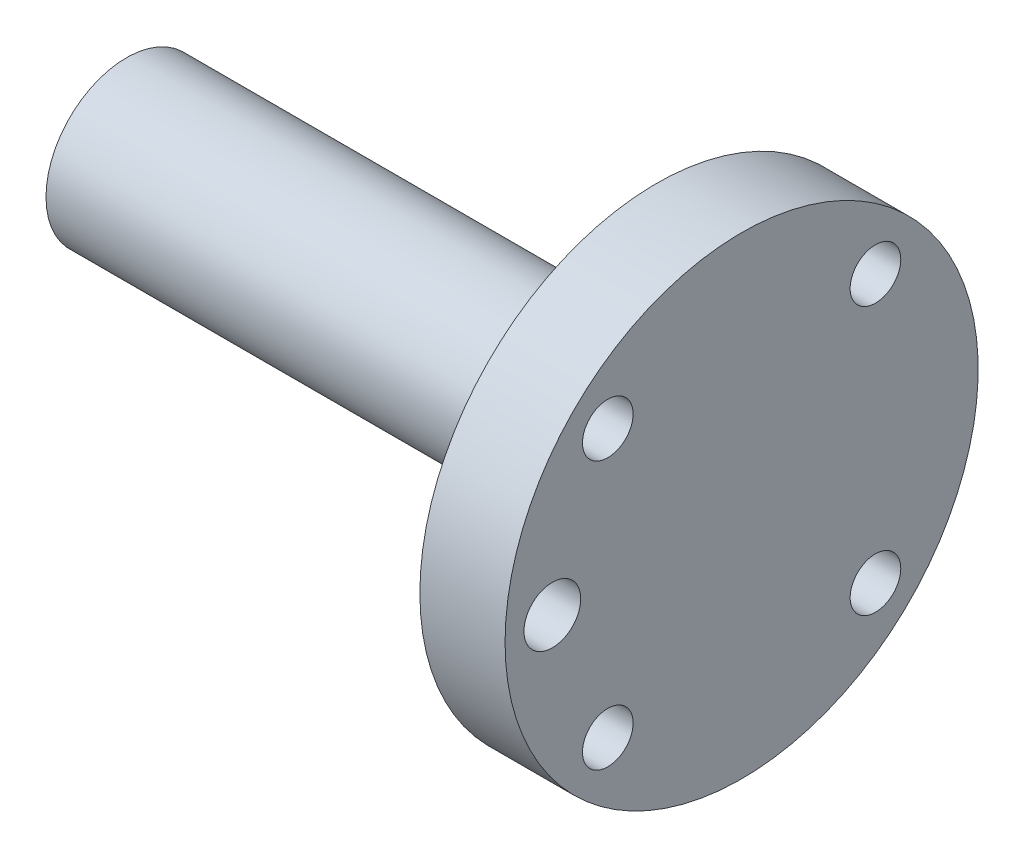
ISO-10303-21;
HEADER;
FILE_DESCRIPTION(('STEP AP214'),'2;1');
FILE_NAME('part.step','',(''),(''),'','','');
FILE_SCHEMA(('AUTOMOTIVE_DESIGN { 1 0 10303 214 1 1 1 1 }'));
ENDSEC;
DATA;
#1=APPLICATION_CONTEXT('core data for automotive mechanical design processes');
#2=APPLICATION_PROTOCOL_DEFINITION('international standard','automotive_design',2000,#1);
#3=PRODUCT_CONTEXT('',#1,'mechanical');
#4=PRODUCT('Part','Part','',(#3));
#5=PRODUCT_RELATED_PRODUCT_CATEGORY('part','',(#4));
#6=PRODUCT_DEFINITION_FORMATION('','',#4);
#7=PRODUCT_DEFINITION_CONTEXT('part definition',#1,'design');
#8=PRODUCT_DEFINITION('design','',#6,#7);
#9=PRODUCT_DEFINITION_SHAPE('','',#8);
#10=(LENGTH_UNIT() NAMED_UNIT(*) SI_UNIT(.MILLI.,.METRE.));
#11=(NAMED_UNIT(*) PLANE_ANGLE_UNIT() SI_UNIT($,.RADIAN.));
#12=(NAMED_UNIT(*) SI_UNIT($,.STERADIAN.) SOLID_ANGLE_UNIT());
#13=UNCERTAINTY_MEASURE_WITH_UNIT(LENGTH_MEASURE(1.E-05),#10,'distance_accuracy_value','');
#14=(GEOMETRIC_REPRESENTATION_CONTEXT(3) GLOBAL_UNCERTAINTY_ASSIGNED_CONTEXT((#13)) GLOBAL_UNIT_ASSIGNED_CONTEXT((#10,
#11,#12)) REPRESENTATION_CONTEXT('',''));
#15=CARTESIAN_POINT('',(0.,0.,0.));
#16=DIRECTION('',(0.,0.,1.));
#17=DIRECTION('',(1.,0.,0.));
#18=AXIS2_PLACEMENT_3D('',#15,#16,#17);
#19=CARTESIAN_POINT('',(750.,8.50199999999974,1186.5));
#20=DIRECTION('',(-1.,0.,0.));
#21=DIRECTION('',(0.,0.,1.));
#22=AXIS2_PLACEMENT_3D('',#19,#20,#21);
#23=PLANE('',#22);
#24=CARTESIAN_POINT('',(750.,0.00199999999958308,1186.5));
#25=DIRECTION('',(-1.,0.,0.));
#26=DIRECTION('',(0.,0.,1.));
#27=AXIS2_PLACEMENT_3D('',#24,#25,#26);
#28=CIRCLE('',#27,8.50000000000017);
#29=CARTESIAN_POINT('',(750.,0.00199999999958308,1195.));
#30=VERTEX_POINT('',#29);
#31=EDGE_CURVE('E19',#30,#30,#28,.F.);
#32=ORIENTED_EDGE('',*,*,#31,.F.);
#33=EDGE_LOOP('',(#32));
#34=FACE_BOUND('',#33,.T.);
#35=ADVANCED_FACE('F15',(#34),#23,.T.);
#36=CARTESIAN_POINT('',(750.,0.00199999999958308,1186.5));
#37=DIRECTION('',(-1.,0.,0.));
#38=DIRECTION('',(0.,0.,1.));
#39=AXIS2_PLACEMENT_3D('',#36,#37,#38);
#40=CYLINDRICAL_SURFACE('',#39,8.50000000000017);
#41=CARTESIAN_POINT('',(801.886087953089,0.00199999999960264,1186.5));
#42=DIRECTION('',(1.,0.,0.));
#43=DIRECTION('',(0.,1.,0.));
#44=AXIS2_PLACEMENT_3D('',#41,#42,#43);
#45=CIRCLE('',#44,8.50000000000013);
#46=CARTESIAN_POINT('',(801.886087953089,8.50199999999974,1186.5));
#47=VERTEX_POINT('',#46);
#48=EDGE_CURVE('E31',#47,#47,#45,.T.);
#49=ORIENTED_EDGE('',*,*,#48,.F.);
#50=EDGE_LOOP('',(#49));
#51=FACE_BOUND('',#50,.T.);
#52=ORIENTED_EDGE('',*,*,#31,.T.);
#53=EDGE_LOOP('',(#52));
#54=FACE_BOUND('',#53,.T.);
#55=ADVANCED_FACE('F66',(#51,#54),#40,.T.);
#56=CARTESIAN_POINT('',(805.998777568908,0.00199999999959261,1186.5));
#57=DIRECTION('',(1.,0.,0.));
#58=DIRECTION('',(0.,0.,-1.));
#59=AXIS2_PLACEMENT_3D('',#56,#57,#58);
#60=CONICAL_SURFACE('',#59,24.9950970966793,1.3264502315157);
#61=CARTESIAN_POINT('',(805.998777568908,0.00199999999958308,1186.5));
#62=DIRECTION('',(-1.,0.,0.));
#63=DIRECTION('',(0.,0.,1.));
#64=AXIS2_PLACEMENT_3D('',#61,#62,#63);
#65=CIRCLE('',#64,24.9950970966792);
#66=CARTESIAN_POINT('',(805.998777568908,0.00199999999958308,1211.49509709668));
#67=VERTEX_POINT('',#66);
#68=EDGE_CURVE('E89',#67,#67,#65,.F.);
#69=ORIENTED_EDGE('',*,*,#68,.F.);
#70=EDGE_LOOP('',(#69));
#71=FACE_BOUND('',#70,.T.);
#72=CARTESIAN_POINT('',(804.306317276133,-14.1401356279621,1175.0328643805));
#73=CARTESIAN_POINT('',(804.336143372181,-14.294141666813,1175.03285838061));
#74=CARTESIAN_POINT('',(804.36821619254,-14.4479391191232,1175.01951127642));
#75=CARTESIAN_POINT('',(804.435601045556,-14.7505341127896,1174.96683466761));
#76=CARTESIAN_POINT('',(804.470920752985,-14.8993186094879,1174.92744216448));
#77=CARTESIAN_POINT('',(804.543492453151,-15.1873102728506,1174.82411545223));
#78=CARTESIAN_POINT('',(804.580740919321,-15.3265339066501,1174.76022475459));
#79=CARTESIAN_POINT('',(804.656062215643,-15.5918298625371,1174.6098533582));
#80=CARTESIAN_POINT('',(804.694134621056,-15.7179087744918,1174.52338405576));
#81=CARTESIAN_POINT('',(804.770621651566,-15.9553237915676,1174.32880677216));
#82=CARTESIAN_POINT('',(804.809033045368,-16.0664151069824,1174.22039853297));
#83=CARTESIAN_POINT('',(804.884596137918,-16.2684091581914,1173.98575998604));
#84=CARTESIAN_POINT('',(804.921747674927,-16.3593093101102,1173.85952740068));
#85=CARTESIAN_POINT('',(804.993782553742,-16.518022559099,1173.59290261411));
#86=CARTESIAN_POINT('',(805.028668385499,-16.5858613595943,1173.45252640475));
#87=CARTESIAN_POINT('',(805.09532779561,-16.6963139649367,1173.16147938809));
#88=CARTESIAN_POINT('',(805.127101659782,-16.7389300881767,1173.01080952838));
#89=CARTESIAN_POINT('',(805.186203342983,-16.7967884160814,1172.70630915658));
#90=CARTESIAN_POINT('',(805.213599747449,-16.8125005802318,1172.55258139515));
#91=CARTESIAN_POINT('',(805.263928013503,-16.8171598885835,1172.24398703233));
#92=CARTESIAN_POINT('',(805.28686049857,-16.8061107734636,1172.08912059312));
#93=CARTESIAN_POINT('',(805.327167703311,-16.7578417994512,1171.78683044004));
#94=CARTESIAN_POINT('',(805.344667368647,-16.7212851411307,1171.63931747325));
#95=CARTESIAN_POINT('',(805.374439636682,-16.6235096237418,1171.35214285461));
#96=CARTESIAN_POINT('',(805.386712891221,-16.5622938420295,1171.21248022555));
#97=CARTESIAN_POINT('',(805.405511286793,-16.4184790463776,1170.94829338624));
#98=CARTESIAN_POINT('',(805.412159162606,-16.336390360328,1170.82349992149));
#99=CARTESIAN_POINT('',(805.420003971243,-16.1525132927662,1170.5892130436));
#100=CARTESIAN_POINT('',(805.421201888333,-16.0507284718484,1170.47971687122));
#101=CARTESIAN_POINT('',(805.418139572981,-15.8317937912344,1170.28047260955));
#102=CARTESIAN_POINT('',(805.413947294223,-15.7148516146504,1170.19049504756));
#103=CARTESIAN_POINT('',(805.400317242125,-15.4679374711301,1170.03102741576));
#104=CARTESIAN_POINT('',(805.390876944669,-15.3379592589852,1169.96154722913));
#105=CARTESIAN_POINT('',(805.366951011519,-15.0684961580842,1169.84481893532));
#106=CARTESIAN_POINT('',(805.352453971231,-14.9289903583631,1169.79762165444));
#107=CARTESIAN_POINT('',(805.318773281409,-14.6448786042143,1169.72685434754));
#108=CARTESIAN_POINT('',(805.299599729957,-14.500284205813,1169.70323396377));
#109=CARTESIAN_POINT('',(805.273080246462,-14.3194299654734,1169.68863664215));
#110=CARTESIAN_POINT('',(805.267699690944,-14.2835805130328,1169.68647215931));
#111=CARTESIAN_POINT('',(805.256688453501,-14.2118636617517,1169.68358539827));
#112=CARTESIAN_POINT('',(805.251057782854,-14.1759962637924,1169.68286305511));
#113=CARTESIAN_POINT('',(805.220797671938,-13.9874325720055,1169.6828700243));
#114=CARTESIAN_POINT('',(805.194041532217,-13.8348521308595,1169.69599764243));
#115=CARTESIAN_POINT('',(805.136704145133,-13.5345922541712,1169.74783442174));
#116=CARTESIAN_POINT('',(805.106113530124,-13.3869259819765,1169.78660726192));
#117=CARTESIAN_POINT('',(805.04193584684,-13.1011329308733,1169.88824111308));
#118=CARTESIAN_POINT('',(805.00835452378,-12.9629887287665,1169.95105667197));
#119=CARTESIAN_POINT('',(804.938979000183,-12.6997644421062,1170.09872105318));
#120=CARTESIAN_POINT('',(804.903185915055,-12.574677856725,1170.18355883751));
#121=CARTESIAN_POINT('',(804.829592199727,-12.3386793910744,1170.37447861403));
#122=CARTESIAN_POINT('',(804.791767228396,-12.2280581248542,1170.48091057271));
#123=CARTESIAN_POINT('',(804.715693679786,-12.0266322742619,1170.7110136012));
#124=CARTESIAN_POINT('',(804.677445018544,-11.9358316943029,1170.83468814631));
#125=CARTESIAN_POINT('',(804.601108257253,-11.7755696163017,1171.09753003664));
#126=CARTESIAN_POINT('',(804.563028389942,-11.7063942808929,1171.23687445983));
#127=CARTESIAN_POINT('',(804.48871046861,-11.5930794378869,1171.52586789723));
#128=CARTESIAN_POINT('',(804.45247241631,-11.5489399536575,1171.67551692105));
#129=CARTESIAN_POINT('',(804.383290418945,-11.4874325997067,1171.98001032839));
#130=CARTESIAN_POINT('',(804.350328383028,-11.4699090732043,1172.13481905119));
#131=CARTESIAN_POINT('',(804.288725742545,-11.4620636338689,1172.44599256865));
#132=CARTESIAN_POINT('',(804.26008456454,-11.4717381081324,1172.60235715387));
#133=CARTESIAN_POINT('',(804.209048415721,-11.5178450147015,1172.90781229938));
#134=CARTESIAN_POINT('',(804.186508583162,-11.5535647340541,1173.05698592985));
#135=CARTESIAN_POINT('',(804.147746227266,-11.6503171982215,1173.34775776347));
#136=CARTESIAN_POINT('',(804.131522259481,-11.7113441486365,1173.48935769234));
#137=CARTESIAN_POINT('',(804.106671271517,-11.8544939540421,1173.75553115727));
#138=CARTESIAN_POINT('',(804.097789990909,-11.9357711324302,1173.88053602926));
#139=CARTESIAN_POINT('',(804.087102903757,-12.1181249836216,1174.115475217));
#140=CARTESIAN_POINT('',(804.085295246656,-12.2191964706932,1174.22541346712));
#141=CARTESIAN_POINT('',(804.088798604648,-12.4353595318403,1174.42435933408));
#142=CARTESIAN_POINT('',(804.093931300282,-12.5500334062373,1174.51382475597));
#143=CARTESIAN_POINT('',(804.110755883485,-12.7920608074352,1174.67287880562));
#144=CARTESIAN_POINT('',(804.122450650106,-12.9194198795694,1174.74245868853));
#145=CARTESIAN_POINT('',(804.151896424036,-13.1834958030153,1174.86015282517));
#146=CARTESIAN_POINT('',(804.169666814994,-13.3202414713049,1174.90819722418));
#147=CARTESIAN_POINT('',(804.210462397092,-13.5987567443111,1174.98145034953));
#148=CARTESIAN_POINT('',(804.233477619382,-13.7405163925935,1175.00670195214));
#149=CARTESIAN_POINT('',(804.266208518885,-13.925648086296,1175.02460022908));
#150=CARTESIAN_POINT('',(804.273975802753,-13.9685317257339,1175.02769985931));
#151=CARTESIAN_POINT('',(804.289876398083,-14.0543275149698,1175.03183270183));
#152=CARTESIAN_POINT('',(804.298009685144,-14.0972396626797,1175.03286605167));
#153=CARTESIAN_POINT('',(804.306317276133,-14.1401356279621,1175.0328643805));
#154=B_SPLINE_CURVE_WITH_KNOTS('',3,(#72,#73,#74,#75,#76,#77,#78,#79,#80,#81,#82,#83,#84,#85,
#86,#87,#88,#89,#90,#91,#92,#93,#94,#95,#96,#97,#98,#99,#100,#101,#102,#103,#104,#105,#106,#107,
#108,#109,#110,#111,#112,#113,#114,#115,#116,#117,#118,#119,#120,#121,#122,#123,#124,#125,#126,
#127,#128,#129,#130,#131,#132,#133,#134,#135,#136,#137,#138,#139,#140,#141,#142,#143,#144,#145,
#146,#147,#148,#149,#150,#151,#152,#153),.UNSPECIFIED.,.T.,.F.,(4,2,2,2,2,2,2,2,2,2,2,2,2,2,2,2,
2,2,2,2,2,2,2,2,2,2,2,2,2,2,2,2,2,2,2,2,2,2,2,2,4),(0.,0.470433945646241,0.942009958367711,
1.4127522512867,1.88325739967577,2.36070003356384,2.83820373092127,3.31517345986759,
3.79209934037451,4.26060589905821,4.72904697389826,5.18574150354063,5.64237905725131,
6.08877604681168,6.53509241363955,6.97583689771166,7.41679354827737,7.8587511988115,
8.29976284162894,8.40869277676593,8.5176178048172,8.98144629721404,9.44643085562329,
9.91054068084767,10.3744183324921,10.8465199166477,11.3187167923402,11.79692077348,
12.27512520096,12.7505220527168,13.2258557571171,13.6886483191685,14.1513349776597,
14.597235524266,15.0430194093178,15.4775646652589,15.9123007233875,16.3484369085586,
16.7837509434814,16.9147916597382,17.0458236527085),.UNSPECIFIED.);
#155=CARTESIAN_POINT('',(804.306317276133,-14.1401356279621,1175.0328643805));
#156=VERTEX_POINT('',#155);
#157=EDGE_CURVE('E45',#156,#156,#154,.T.);
#158=ORIENTED_EDGE('',*,*,#157,.T.);
#159=EDGE_LOOP('',(#158));
#160=FACE_BOUND('',#159,.T.);
#161=CARTESIAN_POINT('',(804.306317275823,14.1441356195,1175.03286437204));
#162=CARTESIAN_POINT('',(804.277907504522,13.9974342534324,1175.03285851673));
#163=CARTESIAN_POINT('',(804.251462679069,13.8501653361851,1175.02075310957));
#164=CARTESIAN_POINT('',(804.203580217718,13.5586483828597,1174.97219598563));
#165=CARTESIAN_POINT('',(804.182151701003,13.4144062758309,1174.93570038679));
#166=CARTESIAN_POINT('',(804.145269209412,13.1331694066327,1174.83892932152));
#167=CARTESIAN_POINT('',(804.129819001762,12.996179261053,1174.77863890899));
#168=CARTESIAN_POINT('',(804.105669218935,12.7337845841122,1174.63576659407));
#169=CARTESIAN_POINT('',(804.096966142361,12.608374073352,1174.55319628377));
#170=CARTESIAN_POINT('',(804.086857741144,12.3756363006401,1174.37018877821));
#171=CARTESIAN_POINT('',(804.085290689998,12.2679621813766,1174.27020143863));
#172=CARTESIAN_POINT('',(804.089092105359,12.0704741250498,1174.05403170553));
#173=CARTESIAN_POINT('',(804.094460499586,11.9806600018608,1173.93784948081));
#174=CARTESIAN_POINT('',(804.111762464322,11.8223389259218,1173.69418430956));
#175=CARTESIAN_POINT('',(804.123618251663,11.7535942974233,1173.56684997971));
#176=CARTESIAN_POINT('',(804.153290614266,11.6376741609324,1173.3033772598));
#177=CARTESIAN_POINT('',(804.171107492725,11.5904997503511,1173.16723842219));
#178=CARTESIAN_POINT('',(804.21228061868,11.5180655016533,1172.88757646686));
#179=CARTESIAN_POINT('',(804.235724943237,11.4931873535647,1172.74396769188));
#180=CARTESIAN_POINT('',(804.287042696802,11.4669898123264,1172.45540715321));
#181=CARTESIAN_POINT('',(804.314916823706,11.4656741350597,1172.31045518131));
#182=CARTESIAN_POINT('',(804.375098816421,11.4866275364038,1172.01803652923));
#183=CARTESIAN_POINT('',(804.407525167872,11.5096996540118,1171.87065180072));
#184=CARTESIAN_POINT('',(804.474932442195,11.579739731971,1171.58228346559));
#185=CARTESIAN_POINT('',(804.509913821415,11.6267119700396,1171.44130100979));
#186=CARTESIAN_POINT('',(804.582507402846,11.7449853476128,1171.16496736785));
#187=CARTESIAN_POINT('',(804.620167999316,11.8170184921713,1171.02994183505));
#188=CARTESIAN_POINT('',(804.69595262147,11.982917372649,1170.77419875663));
#189=CARTESIAN_POINT('',(804.734076660341,12.0767837312358,1170.65348161923));
#190=CARTESIAN_POINT('',(804.810340745722,12.2854037191325,1170.42791477109));
#191=CARTESIAN_POINT('',(804.848471772778,12.4004602134764,1170.32334182446));
#192=CARTESIAN_POINT('',(804.923142775805,12.6473276716513,1170.13541996749));
#193=CARTESIAN_POINT('',(804.959682004648,12.7791463916588,1170.05208093643));
#194=CARTESIAN_POINT('',(805.030074064899,13.0552662364763,1169.90958868758));
#195=CARTESIAN_POINT('',(805.063936154956,13.1995203770213,1169.85034888544));
#196=CARTESIAN_POINT('',(805.128215995714,13.4966121777536,1169.75777819752));
#197=CARTESIAN_POINT('',(805.158641210583,13.6494301146449,1169.72439020563));
#198=CARTESIAN_POINT('',(805.197252900379,13.8604344832411,1169.69734335988));
#199=CARTESIAN_POINT('',(805.207270998524,13.9169599675381,1169.69192297492));
#200=CARTESIAN_POINT('',(805.226728143163,14.0303435664273,1169.68468214967));
#201=CARTESIAN_POINT('',(805.236167162808,14.0872016963087,1169.68286187619));
#202=CARTESIAN_POINT('',(805.268957989993,14.2915523620684,1169.68287083443));
#203=CARTESIAN_POINT('',(805.290580252431,14.4394772433358,1169.69509763179));
#204=CARTESIAN_POINT('',(805.329218398687,14.732039507295,1169.74404343243));
#205=CARTESIAN_POINT('',(805.346225866004,14.8766704483713,1169.78080676892));
#206=CARTESIAN_POINT('',(805.375196313336,15.1582867614334,1169.87808619387));
#207=CARTESIAN_POINT('',(805.387159210842,15.2952720083357,1169.9386026708));
#208=CARTESIAN_POINT('',(805.405739506553,15.5574472063806,1170.08179790778));
#209=CARTESIAN_POINT('',(805.412359255579,15.6826423233807,1170.16446690003));
#210=CARTESIAN_POINT('',(805.420052948293,15.9161309825548,1170.34851519349));
#211=CARTESIAN_POINT('',(805.421193771336,16.0246126190325,1170.44965313201));
#212=CARTESIAN_POINT('',(805.418083248875,16.2233638538092,1170.66840491269));
#213=CARTESIAN_POINT('',(805.413831783803,16.3136330482118,1170.78601912015));
#214=CARTESIAN_POINT('',(805.400077554574,16.4729819314918,1171.03360806554));
#215=CARTESIAN_POINT('',(805.390603978363,16.5421761073632,1171.16351080595));
#216=CARTESIAN_POINT('',(805.366649790613,16.6582488929693,1171.43249026102));
#217=CARTESIAN_POINT('',(805.35216911603,16.7051272217078,1171.57156709119));
#218=CARTESIAN_POINT('',(805.318396442475,16.7757837560654,1171.85614223758));
#219=CARTESIAN_POINT('',(805.29906548755,16.7993668991645,1172.00168428871));
#220=CARTESIAN_POINT('',(805.256100531223,16.8223916816202,1172.29402924614));
#221=CARTESIAN_POINT('',(805.232466170659,16.8218313050347,1172.44083225672));
#222=CARTESIAN_POINT('',(805.180930165152,16.7966570096041,1172.73456368663));
#223=CARTESIAN_POINT('',(805.152954384405,16.7715749009282,1172.8814388789));
#224=CARTESIAN_POINT('',(805.093729855751,16.697685499019,1173.16840054881));
#225=CARTESIAN_POINT('',(805.062480677621,16.6488750840989,1173.30848613055));
#226=CARTESIAN_POINT('',(804.996617367712,16.5276367208207,1173.58155109252));
#227=CARTESIAN_POINT('',(804.961939091197,16.4546540888711,1173.71426875059));
#228=CARTESIAN_POINT('',(804.890735046392,16.2876924679065,1173.96519295448));
#229=CARTESIAN_POINT('',(804.854209206633,16.1937126661777,1174.08339893833));
#230=CARTESIAN_POINT('',(804.779416990387,15.9852164980228,1174.30456226261));
#231=CARTESIAN_POINT('',(804.741130092465,15.870303564692,1174.40713899669));
#232=CARTESIAN_POINT('',(804.664580792164,15.6245313342803,1174.5911648487));
#233=CARTESIAN_POINT('',(804.626318416198,15.4936629826092,1174.67260188722));
#234=CARTESIAN_POINT('',(804.550576273922,15.2182810633414,1174.81264599531));
#235=CARTESIAN_POINT('',(804.513108217251,15.0736437226942,1174.87101571667));
#236=CARTESIAN_POINT('',(804.440627944513,14.7760894619912,1174.96177633558));
#237=CARTESIAN_POINT('',(804.405610438063,14.6231917253797,1174.9942248777));
#238=CARTESIAN_POINT('',(804.360961597419,14.4147479343664,1175.0196933365));
#239=CARTESIAN_POINT('',(804.349683911708,14.3608233693871,1175.02462393442));
#240=CARTESIAN_POINT('',(804.327620131863,14.2526703476335,1175.03121064566));
#241=CARTESIAN_POINT('',(804.316834070719,14.1984418707394,1175.03286653957));
#242=CARTESIAN_POINT('',(804.306317275823,14.1441356195,1175.03286437204));
#243=B_SPLINE_CURVE_WITH_KNOTS('',3,(#161,#162,#163,#164,#165,#166,#167,#168,#169,#170,#171,
#172,#173,#174,#175,#176,#177,#178,#179,#180,#181,#182,#183,#184,#185,#186,#187,#188,#189,#190,
#191,#192,#193,#194,#195,#196,#197,#198,#199,#200,#201,#202,#203,#204,#205,#206,#207,#208,#209,
#210,#211,#212,#213,#214,#215,#216,#217,#218,#219,#220,#221,#222,#223,#224,#225,#226,#227,#228,
#229,#230,#231,#232,#233,#234,#235,#236,#237,#238,#239,#240,#241,#242),.UNSPECIFIED.,.T.,.F.,(4,
2,2,2,2,2,2,2,2,2,2,2,2,2,2,2,2,2,2,2,2,2,2,2,2,2,2,2,2,2,2,2,2,2,2,2,2,2,2,2,4),(0.,
0.448077991072641,0.896964328107988,1.34613307155212,1.79506856433991,2.23377730734627,
2.67248147816449,3.10603735439041,3.53961528584343,3.98048121406555,4.4214166677535,
4.87733715428734,5.33333927159849,5.80396724700234,6.2746086460261,6.75258856358972,
7.230790461188,7.70725875708035,8.18267151777713,8.35556770741406,8.52847190724597,
8.9761658739878,9.42467094275234,9.87318334691234,10.321498311581,10.7643266961771,
11.2071649002791,11.647552683882,12.0879460126047,12.5319964880755,12.9760840410647,
13.4288194531858,13.8816144431285,14.3456171570284,14.8096378336711,15.2835920205528,
15.7578164361868,16.2368006369127,16.7147166644905,16.8805760991085,17.0464466469454),.UNSPECIFIED.);
#244=CARTESIAN_POINT('',(804.306317275823,14.1441356195,1175.03286437204));
#245=VERTEX_POINT('',#244);
#246=EDGE_CURVE('E52',#245,#245,#243,.T.);
#247=ORIENTED_EDGE('',*,*,#246,.T.);
#248=EDGE_LOOP('',(#247));
#249=FACE_BOUND('',#248,.T.);
#250=ORIENTED_EDGE('',*,*,#48,.T.);
#251=EDGE_LOOP('',(#250));
#252=FACE_BOUND('',#251,.T.);
#253=CARTESIAN_POINT('',(805.245302980286,14.1441356279612,1203.3171356195));
#254=CARTESIAN_POINT('',(805.220797671938,13.9914325720046,1203.31712997569));
#255=CARTESIAN_POINT('',(805.194041532217,13.8388521308586,1203.30400235757));
#256=CARTESIAN_POINT('',(805.136704145133,13.5385922541703,1203.25216557825));
#257=CARTESIAN_POINT('',(805.106113530124,13.3909259819756,1203.21339273808));
#258=CARTESIAN_POINT('',(805.04193584684,13.1051329308724,1203.11175888692));
#259=CARTESIAN_POINT('',(805.00835452378,12.9669887287656,1203.04894332803));
#260=CARTESIAN_POINT('',(804.938979000183,12.7037644421053,1202.90127894682));
#261=CARTESIAN_POINT('',(804.903185915055,12.5786778567241,1202.81644116249));
#262=CARTESIAN_POINT('',(804.829592199727,12.3426793910735,1202.62552138597));
#263=CARTESIAN_POINT('',(804.791767228396,12.2320581248532,1202.51908942729));
#264=CARTESIAN_POINT('',(804.715693679786,12.0306322742609,1202.2889863988));
#265=CARTESIAN_POINT('',(804.677445018544,11.939831694302,1202.16531185369));
#266=CARTESIAN_POINT('',(804.601108257253,11.7795696163008,1201.90246996336));
#267=CARTESIAN_POINT('',(804.563028389942,11.7103942808919,1201.76312554017));
#268=CARTESIAN_POINT('',(804.48871046861,11.597079437886,1201.47413210277));
#269=CARTESIAN_POINT('',(804.45247241631,11.5529399536565,1201.32448307894));
#270=CARTESIAN_POINT('',(804.383290418945,11.4914325997058,1201.01998967161));
#271=CARTESIAN_POINT('',(804.350328383028,11.4739090732034,1200.86518094881));
#272=CARTESIAN_POINT('',(804.288725742545,11.466063633868,1200.55400743135));
#273=CARTESIAN_POINT('',(804.26008456454,11.4757381081314,1200.39764284612));
#274=CARTESIAN_POINT('',(804.209048415721,11.5218450147005,1200.09218770062));
#275=CARTESIAN_POINT('',(804.186508583162,11.5575647340531,1199.94301407014));
#276=CARTESIAN_POINT('',(804.147746227266,11.6543171982205,1199.65224223652));
#277=CARTESIAN_POINT('',(804.131522259482,11.7153441486355,1199.51064230766));
#278=CARTESIAN_POINT('',(804.106671271517,11.858493954041,1199.24446884273));
#279=CARTESIAN_POINT('',(804.097789990909,11.9397711324292,1199.11946397074));
#280=CARTESIAN_POINT('',(804.087102903757,12.1221249836206,1198.884524783));
#281=CARTESIAN_POINT('',(804.085295246656,12.2231964706923,1198.77458653287));
#282=CARTESIAN_POINT('',(804.088798604648,12.4393595318393,1198.57564066592));
#283=CARTESIAN_POINT('',(804.093931300282,12.5540334062363,1198.48617524403));
#284=CARTESIAN_POINT('',(804.110755883485,12.7960608074342,1198.32712119438));
#285=CARTESIAN_POINT('',(804.122450650106,12.9234198795684,1198.25754131147));
#286=CARTESIAN_POINT('',(804.151896424036,13.1874958030144,1198.13984717483));
#287=CARTESIAN_POINT('',(804.169666814994,13.3242414713039,1198.09180277581));
#288=CARTESIAN_POINT('',(804.210462397092,13.6027567443101,1198.01854965046));
#289=CARTESIAN_POINT('',(804.233477619382,13.7445163925926,1197.99329804786));
#290=CARTESIAN_POINT('',(804.266208518885,13.929648086295,1197.97539977092));
#291=CARTESIAN_POINT('',(804.273975802754,13.972531725733,1197.97230014069));
#292=CARTESIAN_POINT('',(804.289876398083,14.0583275149688,1197.96816729817));
#293=CARTESIAN_POINT('',(804.298009685144,14.1012396626788,1197.96713394832));
#294=CARTESIAN_POINT('',(804.33614337218,14.2981416668121,1197.96714161939));
#295=CARTESIAN_POINT('',(804.36821619254,14.4519391191223,1197.98048872358));
#296=CARTESIAN_POINT('',(804.435601045556,14.7545341127887,1198.03316533239));
#297=CARTESIAN_POINT('',(804.470920752985,14.903318609487,1198.07255783552));
#298=CARTESIAN_POINT('',(804.543492453151,15.1913102728496,1198.17588454777));
#299=CARTESIAN_POINT('',(804.580740919321,15.3305339066491,1198.23977524541));
#300=CARTESIAN_POINT('',(804.656062215643,15.5958298625361,1198.3901466418));
#301=CARTESIAN_POINT('',(804.694134621056,15.7219087744909,1198.47661594423));
#302=CARTESIAN_POINT('',(804.770621651567,15.9593237915667,1198.67119322784));
#303=CARTESIAN_POINT('',(804.809033045368,16.0704151069815,1198.77960146703));
#304=CARTESIAN_POINT('',(804.884596137918,16.2724091581905,1199.01424001396));
#305=CARTESIAN_POINT('',(804.921747674927,16.3633093101093,1199.14047259932));
#306=CARTESIAN_POINT('',(804.993782553742,16.5220225590981,1199.40709738589));
#307=CARTESIAN_POINT('',(805.028668385499,16.5898613595934,1199.54747359525));
#308=CARTESIAN_POINT('',(805.09532779561,16.7003139649358,1199.83852061191));
#309=CARTESIAN_POINT('',(805.127101659782,16.7429300881758,1199.98919047162));
#310=CARTESIAN_POINT('',(805.186203342983,16.8007884160804,1200.29369084342));
#311=CARTESIAN_POINT('',(805.213599747449,16.8165005802309,1200.44741860485));
#312=CARTESIAN_POINT('',(805.263928013503,16.8211598885825,1200.75601296767));
#313=CARTESIAN_POINT('',(805.28686049857,16.8101107734626,1200.91087940688));
#314=CARTESIAN_POINT('',(805.327167703311,16.7618417994503,1201.21316955995));
#315=CARTESIAN_POINT('',(805.344667368647,16.7252851411298,1201.36068252674));
#316=CARTESIAN_POINT('',(805.374439636682,16.6275096237408,1201.64785714538));
#317=CARTESIAN_POINT('',(805.386712891221,16.5662938420286,1201.78751977444));
#318=CARTESIAN_POINT('',(805.405511286793,16.4224790463767,1202.05170661376));
#319=CARTESIAN_POINT('',(805.412159162606,16.340390360327,1202.17650007851));
#320=CARTESIAN_POINT('',(805.420003971243,16.1565132927653,1202.41078695639));
#321=CARTESIAN_POINT('',(805.421201888333,16.0547284718475,1202.52028312877));
#322=CARTESIAN_POINT('',(805.418139572981,15.8357937912335,1202.71952739044));
#323=CARTESIAN_POINT('',(805.413947294223,15.7188516146495,1202.80950495244));
#324=CARTESIAN_POINT('',(805.400317242125,15.4719374711292,1202.96897258423));
#325=CARTESIAN_POINT('',(805.390876944669,15.3419592589843,1203.03845277087));
#326=CARTESIAN_POINT('',(805.366951011519,15.0724961580832,1203.15518106468));
#327=CARTESIAN_POINT('',(805.352453971231,14.9329903583622,1203.20237834555));
#328=CARTESIAN_POINT('',(805.318773281409,14.6488786042133,1203.27314565245));
#329=CARTESIAN_POINT('',(805.299599729957,14.5042842058121,1203.29676603623));
#330=CARTESIAN_POINT('',(805.273080246462,14.3234299654724,1203.31136335785));
#331=CARTESIAN_POINT('',(805.267699690944,14.2875805130318,1203.31352784069));
#332=CARTESIAN_POINT('',(805.256688453501,14.2158636617508,1203.31641460172));
#333=CARTESIAN_POINT('',(805.251057782854,14.1799962637915,1203.31713694488));
#334=CARTESIAN_POINT('',(805.245302980286,14.1441356279612,1203.3171356195));
#335=B_SPLINE_CURVE_WITH_KNOTS('',3,(#253,#254,#255,#256,#257,#258,#259,#260,#261,#262,#263,
#264,#265,#266,#267,#268,#269,#270,#271,#272,#273,#274,#275,#276,#277,#278,#279,#280,#281,#282,
#283,#284,#285,#286,#287,#288,#289,#290,#291,#292,#293,#294,#295,#296,#297,#298,#299,#300,#301,
#302,#303,#304,#305,#306,#307,#308,#309,#310,#311,#312,#313,#314,#315,#316,#317,#318,#319,#320,
#321,#322,#323,#324,#325,#326,#327,#328,#329,#330,#331,#332,#333,#334),.UNSPECIFIED.,.T.,.F.,(4,
2,2,2,2,2,2,2,2,2,2,2,2,2,2,2,2,2,2,2,2,2,2,2,2,2,2,2,2,2,2,2,2,2,2,2,2,2,2,2,4),(0.,
0.463828492396879,0.928813050806076,1.39292287603047,1.85680052767486,2.32890211183064,
2.80109898752302,3.27930296866281,3.75750739614278,4.23290424789958,4.70823795229993,
5.17103051435113,5.63371717284224,6.07961771944878,6.52540160450064,6.95994686044162,
7.39468291857029,7.83081910374145,8.26613313866416,8.39717385492105,8.52820584789139,
8.99863979353759,9.47021580625907,9.940958099178,10.4114632475672,10.8889058814552,
11.3664095788126,11.843379307759,12.3203051882659,12.7888117469496,13.2572528217896,
13.713947351432,14.1705849051427,14.616981894703,15.0632982615309,15.504042745603,
15.9449993961687,16.3869570467029,16.8279686895203,16.9368986246573,17.0458236527085),.UNSPECIFIED.);
#336=CARTESIAN_POINT('',(805.245302980286,14.1441356279612,1203.3171356195));
#337=VERTEX_POINT('',#336);
#338=EDGE_CURVE('E94',#337,#337,#335,.T.);
#339=ORIENTED_EDGE('',*,*,#338,.T.);
#340=EDGE_LOOP('',(#339));
#341=FACE_BOUND('',#340,.T.);
#342=CARTESIAN_POINT('',(805.245302980542,-14.1401356195004,1203.31713562796));
#343=CARTESIAN_POINT('',(805.268957989993,-14.2875523620689,1203.31712916557));
#344=CARTESIAN_POINT('',(805.290580252431,-14.4354772433362,1203.3049023682));
#345=CARTESIAN_POINT('',(805.329218398687,-14.7280395072955,1203.25595656756));
#346=CARTESIAN_POINT('',(805.346225866003,-14.8726704483718,1203.21919323108));
#347=CARTESIAN_POINT('',(805.375196313335,-15.154286761434,1203.12191380613));
#348=CARTESIAN_POINT('',(805.387159210842,-15.2912720083363,1203.06139732919));
#349=CARTESIAN_POINT('',(805.405739506553,-15.5534472063812,1202.91820209222));
#350=CARTESIAN_POINT('',(805.412359255579,-15.6786423233813,1202.83553309996));
#351=CARTESIAN_POINT('',(805.420052948293,-15.9121309825554,1202.6514848065));
#352=CARTESIAN_POINT('',(805.421193771336,-16.0206126190332,1202.55034686798));
#353=CARTESIAN_POINT('',(805.418083248875,-16.2193638538099,1202.3315950873));
#354=CARTESIAN_POINT('',(805.413831783803,-16.3096330482124,1202.21398087985));
#355=CARTESIAN_POINT('',(805.400077554574,-16.4689819314925,1201.96639193445));
#356=CARTESIAN_POINT('',(805.390603978363,-16.538176107364,1201.83648919405));
#357=CARTESIAN_POINT('',(805.366649790613,-16.6542488929702,1201.56750973897));
#358=CARTESIAN_POINT('',(805.35216911603,-16.7011272217086,1201.42843290881));
#359=CARTESIAN_POINT('',(805.318396442475,-16.7717837560662,1201.14385776242));
#360=CARTESIAN_POINT('',(805.29906548755,-16.7953668991653,1200.99831571129));
#361=CARTESIAN_POINT('',(805.256100531223,-16.8183916816211,1200.70597075385));
#362=CARTESIAN_POINT('',(805.232466170659,-16.8178313050357,1200.55916774328));
#363=CARTESIAN_POINT('',(805.180930165152,-16.7926570096051,1200.26543631337));
#364=CARTESIAN_POINT('',(805.152954384405,-16.7675749009292,1200.11856112109));
#365=CARTESIAN_POINT('',(805.093729855751,-16.69368549902,1199.83159945118));
#366=CARTESIAN_POINT('',(805.062480677621,-16.6448750841,1199.69151386945));
#367=CARTESIAN_POINT('',(804.996617367712,-16.5236367208219,1199.41844890748));
#368=CARTESIAN_POINT('',(804.961939091197,-16.4506540888723,1199.28573124941));
#369=CARTESIAN_POINT('',(804.890735046392,-16.2836924679077,1199.03480704552));
#370=CARTESIAN_POINT('',(804.854209206633,-16.1897126661789,1198.91660106167));
#371=CARTESIAN_POINT('',(804.779416990387,-15.9812164980242,1198.69543773738));
#372=CARTESIAN_POINT('',(804.741130092465,-15.8663035646934,1198.59286100331));
#373=CARTESIAN_POINT('',(804.664580792164,-15.6205313342817,1198.40883515129));
#374=CARTESIAN_POINT('',(804.626318416198,-15.4896629826105,1198.32739811277));
#375=CARTESIAN_POINT('',(804.550576273922,-15.2142810633428,1198.18735400469));
#376=CARTESIAN_POINT('',(804.513108217251,-15.0696437226957,1198.12898428333));
#377=CARTESIAN_POINT('',(804.440627944513,-14.7720894619927,1198.03822366442));
#378=CARTESIAN_POINT('',(804.405610438063,-14.6191917253811,1198.0057751223));
#379=CARTESIAN_POINT('',(804.360961597419,-14.4107479343677,1197.9803066635));
#380=CARTESIAN_POINT('',(804.349683911708,-14.3568233693883,1197.97537606558));
#381=CARTESIAN_POINT('',(804.327620131863,-14.2486703476345,1197.96878935433));
#382=CARTESIAN_POINT('',(804.316834070719,-14.1944418707403,1197.96713346043));
#383=CARTESIAN_POINT('',(804.277907504522,-13.9934342534332,1197.96714148327));
#384=CARTESIAN_POINT('',(804.251462679069,-13.8461653361858,1197.97924689043));
#385=CARTESIAN_POINT('',(804.203580217718,-13.5546483828605,1198.02780401436));
#386=CARTESIAN_POINT('',(804.182151701002,-13.4104062758317,1198.0642996132));
#387=CARTESIAN_POINT('',(804.145269209412,-13.1291694066335,1198.16107067847));
#388=CARTESIAN_POINT('',(804.129819001761,-12.9921792610539,1198.221361091));
#389=CARTESIAN_POINT('',(804.105669218934,-12.729784584113,1198.36423340593));
#390=CARTESIAN_POINT('',(804.09696614236,-12.6043740733529,1198.44680371623));
#391=CARTESIAN_POINT('',(804.086857741144,-12.3716363006409,1198.62981122179));
#392=CARTESIAN_POINT('',(804.085290689998,-12.2639621813775,1198.72979856137));
#393=CARTESIAN_POINT('',(804.089092105359,-12.0664741250507,1198.94596829446));
#394=CARTESIAN_POINT('',(804.094460499586,-11.9766600018616,1199.06215051918));
#395=CARTESIAN_POINT('',(804.111762464322,-11.8183389259225,1199.30581569044));
#396=CARTESIAN_POINT('',(804.123618251663,-11.749594297424,1199.43315002028));
#397=CARTESIAN_POINT('',(804.153290614266,-11.6336741609333,1199.6966227402));
#398=CARTESIAN_POINT('',(804.171107492725,-11.586499750352,1199.83276157781));
#399=CARTESIAN_POINT('',(804.21228061868,-11.5140655016542,1200.11242353314));
#400=CARTESIAN_POINT('',(804.235724943237,-11.4891873535656,1200.25603230812));
#401=CARTESIAN_POINT('',(804.287042696802,-11.4629898123273,1200.54459284678));
#402=CARTESIAN_POINT('',(804.314916823706,-11.4616741350606,1200.68954481869));
#403=CARTESIAN_POINT('',(804.375098816421,-11.4826275364047,1200.98196347077));
#404=CARTESIAN_POINT('',(804.407525167872,-11.5056996540128,1201.12934819928));
#405=CARTESIAN_POINT('',(804.474932442195,-11.575739731972,1201.41771653441));
#406=CARTESIAN_POINT('',(804.509913821415,-11.6227119700406,1201.55869899021));
#407=CARTESIAN_POINT('',(804.582507402846,-11.7409853476138,1201.83503263214));
#408=CARTESIAN_POINT('',(804.620167999316,-11.8130184921723,1201.97005816495));
#409=CARTESIAN_POINT('',(804.69595262147,-11.9789173726499,1202.22580124336));
#410=CARTESIAN_POINT('',(804.734076660341,-12.0727837312368,1202.34651838077));
#411=CARTESIAN_POINT('',(804.810340745722,-12.2814037191335,1202.57208522891));
#412=CARTESIAN_POINT('',(804.848471772778,-12.3964602134774,1202.67665817554));
#413=CARTESIAN_POINT('',(804.923142775805,-12.6433276716524,1202.8645800325));
#414=CARTESIAN_POINT('',(804.959682004648,-12.7751463916598,1202.94791906356));
#415=CARTESIAN_POINT('',(805.030074064899,-13.0512662364774,1203.09041131241));
#416=CARTESIAN_POINT('',(805.063936154956,-13.1955203770224,1203.14965111455));
#417=CARTESIAN_POINT('',(805.128215995714,-13.4926121777548,1203.24222180248));
#418=CARTESIAN_POINT('',(805.158641210583,-13.6454301146461,1203.27560979437));
#419=CARTESIAN_POINT('',(805.197252900379,-13.8564344832422,1203.30265664012));
#420=CARTESIAN_POINT('',(805.207270998524,-13.9129599675391,1203.30807702508));
#421=CARTESIAN_POINT('',(805.226728143163,-14.0263435664281,1203.31531785032));
#422=CARTESIAN_POINT('',(805.236167162808,-14.0832016963093,1203.3171381238));
#423=CARTESIAN_POINT('',(805.245302980542,-14.1401356195004,1203.31713562796));
#424=B_SPLINE_CURVE_WITH_KNOTS('',3,(#342,#343,#344,#345,#346,#347,#348,#349,#350,#351,#352,
#353,#354,#355,#356,#357,#358,#359,#360,#361,#362,#363,#364,#365,#366,#367,#368,#369,#370,#371,
#372,#373,#374,#375,#376,#377,#378,#379,#380,#381,#382,#383,#384,#385,#386,#387,#388,#389,#390,
#391,#392,#393,#394,#395,#396,#397,#398,#399,#400,#401,#402,#403,#404,#405,#406,#407,#408,#409,
#410,#411,#412,#413,#414,#415,#416,#417,#418,#419,#420,#421,#422,#423),.UNSPECIFIED.,.T.,.F.,(4,
2,2,2,2,2,2,2,2,2,2,2,2,2,2,2,2,2,2,2,2,2,2,2,2,2,2,2,2,2,2,2,2,2,2,2,2,2,2,2,4),(0.,
0.447693966741851,0.896199035506351,1.34471143966649,1.79302640433506,2.23585478893117,
2.67869299303308,3.11908077663604,3.55947410535878,4.00352458082932,4.44761213381858,
4.90034754593983,5.35314253588253,5.81714524978263,6.28116592642503,6.75512011330684,
7.22934452894081,7.70832872966679,8.18624475724454,8.35210419186283,8.51797473970003,
8.96605273077269,9.41493906780804,9.86410781125206,10.3130433040398,10.7517520470463,
11.1904562178646,11.6240120940907,12.0575900255435,12.4984559537656,12.9393914074536,
13.3953118939874,13.8513140112986,14.3219419867022,14.7925833857259,15.2705633032896,
15.7487652008881,16.2252334967805,16.7006462574773,16.8735424471139,17.0464466469454),.UNSPECIFIED.);
#425=CARTESIAN_POINT('',(805.245302980542,-14.1401356195004,1203.31713562796));
#426=VERTEX_POINT('',#425);
#427=EDGE_CURVE('E82',#426,#426,#424,.T.);
#428=ORIENTED_EDGE('',*,*,#427,.T.);
#429=EDGE_LOOP('',(#428));
#430=FACE_BOUND('',#429,.T.);
#431=CARTESIAN_POINT('',(804.005375977256,0.00200000598257424,1203.5));
#432=CARTESIAN_POINT('',(804.005378698996,0.165590515972742,1203.50000726628));
#433=CARTESIAN_POINT('',(804.009325582112,0.329413422535701,1203.51344552898));
#434=CARTESIAN_POINT('',(804.024929546932,0.652548416779,1203.56679172132));
#435=CARTESIAN_POINT('',(804.036603664906,0.811849724527948,1203.60675813823));
#436=CARTESIAN_POINT('',(804.067056287631,1.12094929800738,1203.7117161401));
#437=CARTESIAN_POINT('',(804.085821928492,1.27076420076649,1203.77666241583));
#438=CARTESIAN_POINT('',(804.129571818608,1.55713249941069,1203.92941583499));
#439=CARTESIAN_POINT('',(804.15455363273,1.69369105930663,1204.017214027));
#440=CARTESIAN_POINT('',(804.210221600525,1.95275025572973,1204.21491107757));
#441=CARTESIAN_POINT('',(804.241008935118,2.07492710487464,1204.32520532511));
#442=CARTESIAN_POINT('',(804.306760838861,2.29917511819456,1204.56356533669));
#443=CARTESIAN_POINT('',(804.341726433513,2.40124133011577,1204.69163546485));
#444=CARTESIAN_POINT('',(804.415965772035,2.58625798438635,1204.96699211476));
#445=CARTESIAN_POINT('',(804.45535022883,2.66837399068237,1205.11480968547));
#446=CARTESIAN_POINT('',(804.536029067865,2.80655699457865,1205.42167366377));
#447=CARTESIAN_POINT('',(804.577323731557,2.86262013999829,1205.5807217279));
#448=CARTESIAN_POINT('',(804.661739525298,2.94849749941558,1205.91017093943));
#449=CARTESIAN_POINT('',(804.704879892122,2.97756402074164,1206.08076249409));
#450=CARTESIAN_POINT('',(804.790686900541,3.00600654845928,1206.42452956014));
#451=CARTESIAN_POINT('',(804.833353509972,3.00538055119992,1206.59770524512));
#452=CARTESIAN_POINT('',(804.917396117855,2.97420472251456,1206.94301860666));
#453=CARTESIAN_POINT('',(804.958760511435,2.94343789350891,1207.11513964529));
#454=CARTESIAN_POINT('',(805.038813550864,2.85228228214426,1207.45201623267));
#455=CARTESIAN_POINT('',(805.077502277742,2.79189439726719,1207.61677200441));
#456=CARTESIAN_POINT('',(805.150806437455,2.64381315173636,1207.93206251252));
#457=CARTESIAN_POINT('',(805.185464109928,2.55644642808215,1208.08274068298));
#458=CARTESIAN_POINT('',(805.250372117164,2.35642828916421,1208.36732440816));
#459=CARTESIAN_POINT('',(805.280623351248,2.24378204521285,1208.50123338454));
#460=CARTESIAN_POINT('',(805.335337844723,1.99916300942569,1208.74510161118));
#461=CARTESIAN_POINT('',(805.359918721163,1.86769708962044,1208.85554287633));
#462=CARTESIAN_POINT('',(805.403590442355,1.58716409224652,1209.0527722294));
#463=CARTESIAN_POINT('',(805.422679439672,1.43809111550137,1209.13955235734));
#464=CARTESIAN_POINT('',(805.454509351605,1.13044093144861,1209.2847623764));
#465=CARTESIAN_POINT('',(805.467388363114,0.972167762013821,1209.34380816412));
#466=CARTESIAN_POINT('',(805.487127862613,0.647842505122526,1209.4344710995));
#467=CARTESIAN_POINT('',(805.494001983464,0.481808944387827,1209.46615037533));
#468=CARTESIAN_POINT('',(805.498984777458,0.2625693904014,1209.48912040644));
#469=CARTESIAN_POINT('',(805.499868913564,0.210549169513597,1209.49319707471));
#470=CARTESIAN_POINT('',(805.501048730182,0.106360089571338,1209.49863802007));
#471=CARTESIAN_POINT('',(805.501344410136,0.0541912303759093,1209.50000229459));
#472=CARTESIAN_POINT('',(805.50134267611,-0.163452456382098,1209.49999272586));
#473=CARTESIAN_POINT('',(805.498365695135,-0.329129681449085,1209.48625189266));
#474=CARTESIAN_POINT('',(805.486510993207,-0.655975909800005,1209.43165909255));
#475=CARTESIAN_POINT('',(805.477620687347,-0.817134532486106,1209.3907493042));
#476=CARTESIAN_POINT('',(805.454149030561,-1.1299594907076,1209.28315871048));
#477=CARTESIAN_POINT('',(805.439574886993,-1.2816375664939,1209.21651054358));
#478=CARTESIAN_POINT('',(805.405074498114,-1.57144561879035,1209.05957470964));
#479=CARTESIAN_POINT('',(805.385150592375,-1.70958148165553,1208.96929737662));
#480=CARTESIAN_POINT('',(805.340181939364,-1.96995813296485,1208.76689710034));
#481=CARTESIAN_POINT('',(805.315091021028,-2.09203809787451,1208.65457765284));
#482=CARTESIAN_POINT('',(805.260462389698,-2.3156509034238,1208.41199339088));
#483=CARTESIAN_POINT('',(805.230923901181,-2.41718015338507,1208.28172544709));
#484=CARTESIAN_POINT('',(805.167369187226,-2.59916893667848,1208.00401759259));
#485=CARTESIAN_POINT('',(805.133270080239,-2.6791264405154,1207.85626774747));
#486=CARTESIAN_POINT('',(805.061881693397,-2.8131455417451,1207.55018070778));
#487=CARTESIAN_POINT('',(805.024592046576,-2.86720415559157,1207.39184229581));
#488=CARTESIAN_POINT('',(804.946735958998,-2.94924390446254,1207.06500374987));
#489=CARTESIAN_POINT('',(804.906111911923,-2.97655944762816,1206.89635018434));
#490=CARTESIAN_POINT('',(804.82340099595,-3.00227333422881,1206.5572044025));
#491=CARTESIAN_POINT('',(804.781313955507,-3.00066827500389,1206.38671197221));
#492=CARTESIAN_POINT('',(804.695972929759,-2.96839851366481,1206.0454124538));
#493=CARTESIAN_POINT('',(804.652711740303,-2.93719824904255,1205.87465758772));
#494=CARTESIAN_POINT('',(804.567020000632,-2.84580489384112,1205.5408568534));
#495=CARTESIAN_POINT('',(804.524589510349,-2.78560971938905,1205.37781154016));
#496=CARTESIAN_POINT('',(804.441742971669,-2.63747746097796,1205.06353159254));
#497=CARTESIAN_POINT('',(804.401334537758,-2.54944349591095,1204.91234054029));
#498=CARTESIAN_POINT('',(804.324129453416,-2.34792857270639,1204.62694396571));
#499=CARTESIAN_POINT('',(804.287332277628,-2.23445132389592,1204.49273597191));
#500=CARTESIAN_POINT('',(804.219439307145,-1.98724860226946,1204.24774884107));
#501=CARTESIAN_POINT('',(804.18825381466,-1.85391879442116,1204.13659573637));
#502=CARTESIAN_POINT('',(804.13217160759,-1.56910318263728,1203.93841489554));
#503=CARTESIAN_POINT('',(804.107276654552,-1.41761231051062,1203.85139391651));
#504=CARTESIAN_POINT('',(804.065761512084,-1.10637510300304,1203.70716209547));
#505=CARTESIAN_POINT('',(804.048888972369,-0.947083976212568,1203.64903907867));
#506=CARTESIAN_POINT('',(804.023098245102,-0.620629883175008,1203.56047596755));
#507=CARTESIAN_POINT('',(804.01416036254,-0.45348749803367,1203.52996732652));
#508=CARTESIAN_POINT('',(804.008068291168,-0.23740481720408,1203.50918130817));
#509=CARTESIAN_POINT('',(804.007059721668,-0.18959968733679,1203.50574111596));
#510=CARTESIAN_POINT('',(804.005713165203,-0.0938696903703018,1203.5011493948));
#511=CARTESIAN_POINT('',(804.005375179573,-0.0459448230330719,1203.49999787041));
#512=CARTESIAN_POINT('',(804.005375977256,0.00200000598257424,1203.5));
#513=B_SPLINE_CURVE_WITH_KNOTS('',3,(#431,#432,#433,#434,#435,#436,#437,#438,#439,#440,#441,
#442,#443,#444,#445,#446,#447,#448,#449,#450,#451,#452,#453,#454,#455,#456,#457,#458,#459,#460,
#461,#462,#463,#464,#465,#466,#467,#468,#469,#470,#471,#472,#473,#474,#475,#476,#477,#478,#479,
#480,#481,#482,#483,#484,#485,#486,#487,#488,#489,#490,#491,#492,#493,#494,#495,#496,#497,#498,
#499,#500,#501,#502,#503,#504,#505,#506,#507,#508,#509,#510,#511,#512),.UNSPECIFIED.,.T.,.F.,(4,
2,2,2,2,2,2,2,2,2,2,2,2,2,2,2,2,2,2,2,2,2,2,2,2,2,2,2,2,2,2,2,2,2,2,2,2,2,2,2,4),(0.,
0.490584176925574,0.982253565753656,1.47303532361955,1.96362512363096,2.46372396257445,
2.96394579760181,3.48243952513473,4.00100989286769,4.5335480281431,5.06612209913912,
5.6025588042119,6.13897925690964,6.66914420494549,7.1992007983365,7.71700617871874,
8.2349855425794,8.7408437971393,9.24555059799774,9.40206085467834,9.55857125984879,
10.0547280797382,10.5519442277574,11.0485319228917,11.544902801631,12.045918197217,
12.5470210561925,13.0589389592387,13.5709158209401,14.0953335072872,14.6198128945176,
15.1539681752356,15.6881618515837,16.2242354091954,16.7602308644392,17.286701217164,
17.8133188349912,18.3220485027556,18.8295118678396,18.9732911597191,19.1170707376537),.UNSPECIFIED.);
#514=CARTESIAN_POINT('',(804.005375977256,0.00200000598257424,1203.5));
#515=VERTEX_POINT('',#514);
#516=EDGE_CURVE('E88',#515,#515,#513,.T.);
#517=ORIENTED_EDGE('',*,*,#516,.T.);
#518=EDGE_LOOP('',(#517));
#519=FACE_BOUND('',#518,.T.);
#520=ADVANCED_FACE('F60',(#71,#160,#249,#252,#341,#430,#519),#60,.T.);
#521=CARTESIAN_POINT('',(750.,0.00199999999958308,1186.5));
#522=DIRECTION('',(-1.,0.,0.));
#523=DIRECTION('',(0.,0.,1.));
#524=AXIS2_PLACEMENT_3D('',#521,#522,#523);
#525=CYLINDRICAL_SURFACE('',#524,24.9950970966792);
#526=ORIENTED_EDGE('',*,*,#68,.T.);
#527=EDGE_LOOP('',(#526));
#528=FACE_BOUND('',#527,.T.);
#529=CARTESIAN_POINT('',(815.000000000001,0.00199999999958308,1186.5));
#530=DIRECTION('',(-1.,0.,0.));
#531=DIRECTION('',(0.,0.,1.));
#532=AXIS2_PLACEMENT_3D('',#529,#530,#531);
#533=CIRCLE('',#532,24.9950970966792);
#534=CARTESIAN_POINT('',(815.000000000001,0.00199999999958308,1211.49509709668));
#535=VERTEX_POINT('',#534);
#536=EDGE_CURVE('E42',#535,#535,#533,.F.);
#537=ORIENTED_EDGE('',*,*,#536,.F.);
#538=EDGE_LOOP('',(#537));
#539=FACE_BOUND('',#538,.T.);
#540=ADVANCED_FACE('F65',(#528,#539),#525,.T.);
#541=CARTESIAN_POINT('',(804.0180383785,-14.1401356195008,1200.64213562796));
#542=DIRECTION('',(1.,0.,0.));
#543=DIRECTION('',(0.,0.,-1.));
#544=AXIS2_PLACEMENT_3D('',#541,#542,#543);
#545=CYLINDRICAL_SURFACE('',#544,2.67499999999998);
#546=ORIENTED_EDGE('',*,*,#427,.F.);
#547=EDGE_LOOP('',(#546));
#548=FACE_BOUND('',#547,.T.);
#549=CARTESIAN_POINT('',(815.000000000001,-14.1401356195008,1200.64213562796));
#550=DIRECTION('',(1.,0.,0.));
#551=DIRECTION('',(0.,0.,-1.));
#552=AXIS2_PLACEMENT_3D('',#549,#550,#551);
#553=CIRCLE('',#552,2.67499999999998);
#554=CARTESIAN_POINT('',(815.000000000001,-14.1401356195008,1197.96713562796));
#555=VERTEX_POINT('',#554);
#556=EDGE_CURVE('E39',#555,#555,#553,.F.);
#557=ORIENTED_EDGE('',*,*,#556,.F.);
#558=EDGE_LOOP('',(#557));
#559=FACE_BOUND('',#558,.T.);
#560=ADVANCED_FACE('F73',(#548,#559),#545,.F.);
#561=CARTESIAN_POINT('',(803.939408232956,0.00200000598257408,1206.5));
#562=DIRECTION('',(1.,0.,0.));
#563=DIRECTION('',(0.,0.,-1.));
#564=AXIS2_PLACEMENT_3D('',#561,#562,#563);
#565=CYLINDRICAL_SURFACE('',#564,2.99999999999989);
#566=CARTESIAN_POINT('',(815.000000000001,0.00200000598257408,1206.5));
#567=DIRECTION('',(1.,0.,0.));
#568=DIRECTION('',(0.,0.,-1.));
#569=AXIS2_PLACEMENT_3D('',#566,#567,#568);
#570=CIRCLE('',#569,2.99999999999989);
#571=CARTESIAN_POINT('',(815.000000000001,0.00200000598257408,1203.5));
#572=VERTEX_POINT('',#571);
#573=EDGE_CURVE('E36',#572,#572,#570,.F.);
#574=ORIENTED_EDGE('',*,*,#573,.F.);
#575=EDGE_LOOP('',(#574));
#576=FACE_BOUND('',#575,.T.);
#577=ORIENTED_EDGE('',*,*,#516,.F.);
#578=EDGE_LOOP('',(#577));
#579=FACE_BOUND('',#578,.T.);
#580=ADVANCED_FACE('F78',(#576,#579),#565,.F.);
#581=CARTESIAN_POINT('',(804.016401959602,14.1441356279612,1200.6421356195));
#582=DIRECTION('',(1.,0.,0.));
#583=DIRECTION('',(0.,0.,-1.));
#584=AXIS2_PLACEMENT_3D('',#581,#582,#583);
#585=CYLINDRICAL_SURFACE('',#584,2.67499999999998);
#586=ORIENTED_EDGE('',*,*,#338,.F.);
#587=EDGE_LOOP('',(#586));
#588=FACE_BOUND('',#587,.T.);
#589=CARTESIAN_POINT('',(815.000000000001,14.1441356279612,1200.6421356195));
#590=DIRECTION('',(1.,0.,0.));
#591=DIRECTION('',(0.,0.,-1.));
#592=AXIS2_PLACEMENT_3D('',#589,#590,#591);
#593=CIRCLE('',#592,2.67499999999998);
#594=CARTESIAN_POINT('',(815.000000000001,14.1441356279612,1197.9671356195));
#595=VERTEX_POINT('',#594);
#596=EDGE_CURVE('E28',#595,#595,#593,.F.);
#597=ORIENTED_EDGE('',*,*,#596,.F.);
#598=EDGE_LOOP('',(#597));
#599=FACE_BOUND('',#598,.T.);
#600=ADVANCED_FACE('F99',(#588,#599),#585,.F.);
#601=CARTESIAN_POINT('',(804.24215517979,14.1441356194999,1172.35786437204));
#602=DIRECTION('',(1.,0.,0.));
#603=DIRECTION('',(0.,0.,-1.));
#604=AXIS2_PLACEMENT_3D('',#601,#602,#603);
#605=CYLINDRICAL_SURFACE('',#604,2.67499999999998);
#606=ORIENTED_EDGE('',*,*,#246,.F.);
#607=EDGE_LOOP('',(#606));
#608=FACE_BOUND('',#607,.T.);
#609=CARTESIAN_POINT('',(815.000000000001,14.1441356194999,1172.35786437204));
#610=DIRECTION('',(1.,0.,0.));
#611=DIRECTION('',(0.,0.,-1.));
#612=AXIS2_PLACEMENT_3D('',#609,#610,#611);
#613=CIRCLE('',#612,2.67499999999998);
#614=CARTESIAN_POINT('',(815.000000000001,14.1441356194999,1169.68286437204));
#615=VERTEX_POINT('',#614);
#616=EDGE_CURVE('E23',#615,#615,#613,.F.);
#617=ORIENTED_EDGE('',*,*,#616,.F.);
#618=EDGE_LOOP('',(#617));
#619=FACE_BOUND('',#618,.T.);
#620=ADVANCED_FACE('F102',(#608,#619),#605,.F.);
#621=CARTESIAN_POINT('',(804.242155179478,-14.1401356279621,1172.3578643805));
#622=DIRECTION('',(1.,0.,0.));
#623=DIRECTION('',(0.,0.,-1.));
#624=AXIS2_PLACEMENT_3D('',#621,#622,#623);
#625=CYLINDRICAL_SURFACE('',#624,2.67499999999998);
#626=ORIENTED_EDGE('',*,*,#157,.F.);
#627=EDGE_LOOP('',(#626));
#628=FACE_BOUND('',#627,.T.);
#629=CARTESIAN_POINT('',(815.000000000001,-14.1401356279621,1172.3578643805));
#630=DIRECTION('',(1.,0.,0.));
#631=DIRECTION('',(0.,0.,-1.));
#632=AXIS2_PLACEMENT_3D('',#629,#630,#631);
#633=CIRCLE('',#632,2.67499999999998);
#634=CARTESIAN_POINT('',(815.000000000001,-14.1401356279621,1169.6828643805));
#635=VERTEX_POINT('',#634);
#636=EDGE_CURVE('E10',#635,#635,#633,.F.);
#637=ORIENTED_EDGE('',*,*,#636,.F.);
#638=EDGE_LOOP('',(#637));
#639=FACE_BOUND('',#638,.T.);
#640=ADVANCED_FACE('F58',(#628,#639),#625,.F.);
#641=CARTESIAN_POINT('',(815.000000000001,0.00199999999958308,1186.5));
#642=DIRECTION('',(1.,0.,0.));
#643=DIRECTION('',(0.,0.,-1.));
#644=AXIS2_PLACEMENT_3D('',#641,#642,#643);
#645=PLANE('',#644);
#646=ORIENTED_EDGE('',*,*,#636,.T.);
#647=EDGE_LOOP('',(#646));
#648=FACE_BOUND('',#647,.T.);
#649=ORIENTED_EDGE('',*,*,#616,.T.);
#650=EDGE_LOOP('',(#649));
#651=FACE_BOUND('',#650,.T.);
#652=ORIENTED_EDGE('',*,*,#596,.T.);
#653=EDGE_LOOP('',(#652));
#654=FACE_BOUND('',#653,.T.);
#655=ORIENTED_EDGE('',*,*,#573,.T.);
#656=EDGE_LOOP('',(#655));
#657=FACE_BOUND('',#656,.T.);
#658=ORIENTED_EDGE('',*,*,#556,.T.);
#659=EDGE_LOOP('',(#658));
#660=FACE_BOUND('',#659,.T.);
#661=ORIENTED_EDGE('',*,*,#536,.T.);
#662=EDGE_LOOP('',(#661));
#663=FACE_BOUND('',#662,.T.);
#664=ADVANCED_FACE('F17',(#648,#651,#654,#657,#660,#663),#645,.T.);
#665=CLOSED_SHELL('',(#35,#55,#520,#540,#560,#580,#600,#620,#640,#664));
#666=MANIFOLD_SOLID_BREP('B1',#665);
#667=ADVANCED_BREP_SHAPE_REPRESENTATION('',(#18,#666),#14);
#668=SHAPE_DEFINITION_REPRESENTATION(#9,#667);
ENDSEC;
END-ISO-10303-21;
